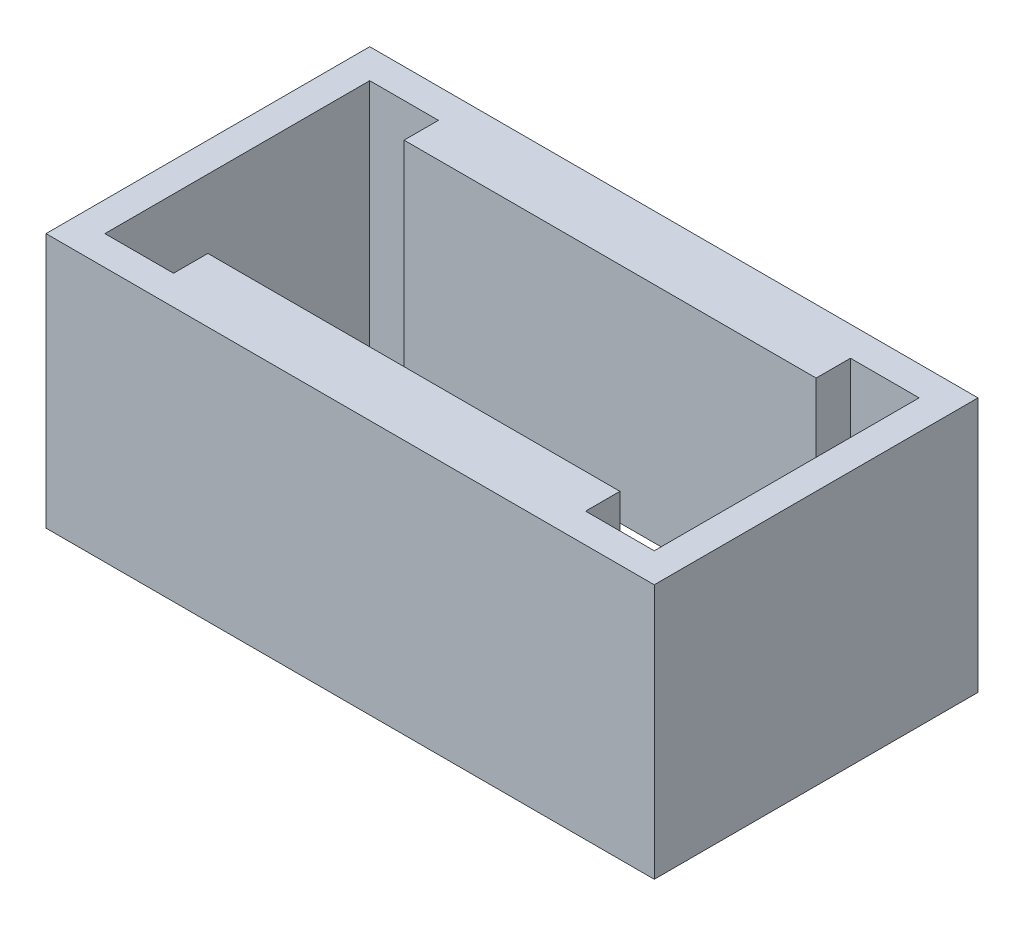
ISO-10303-21;
HEADER;
FILE_DESCRIPTION(('STEP AP214'),'2;1');
FILE_NAME('part.step','',(''),(''),'','','');
FILE_SCHEMA(('AUTOMOTIVE_DESIGN { 1 0 10303 214 1 1 1 1 }'));
ENDSEC;
DATA;
#1=APPLICATION_CONTEXT('core data for automotive mechanical design processes');
#2=APPLICATION_PROTOCOL_DEFINITION('international standard','automotive_design',2000,#1);
#3=PRODUCT_CONTEXT('',#1,'mechanical');
#4=PRODUCT('Part','Part','',(#3));
#5=PRODUCT_RELATED_PRODUCT_CATEGORY('part','',(#4));
#6=PRODUCT_DEFINITION_FORMATION('','',#4);
#7=PRODUCT_DEFINITION_CONTEXT('part definition',#1,'design');
#8=PRODUCT_DEFINITION('design','',#6,#7);
#9=PRODUCT_DEFINITION_SHAPE('','',#8);
#10=(LENGTH_UNIT() NAMED_UNIT(*) SI_UNIT(.MILLI.,.METRE.));
#11=(NAMED_UNIT(*) PLANE_ANGLE_UNIT() SI_UNIT($,.RADIAN.));
#12=(NAMED_UNIT(*) SI_UNIT($,.STERADIAN.) SOLID_ANGLE_UNIT());
#13=UNCERTAINTY_MEASURE_WITH_UNIT(LENGTH_MEASURE(1.E-05),#10,'distance_accuracy_value','');
#14=(GEOMETRIC_REPRESENTATION_CONTEXT(3) GLOBAL_UNCERTAINTY_ASSIGNED_CONTEXT((#13)) GLOBAL_UNIT_ASSIGNED_CONTEXT((#10,
#11,#12)) REPRESENTATION_CONTEXT('',''));
#15=CARTESIAN_POINT('',(0.,0.,0.));
#16=DIRECTION('',(0.,0.,1.));
#17=DIRECTION('',(1.,0.,0.));
#18=AXIS2_PLACEMENT_3D('',#15,#16,#17);
#19=CARTESIAN_POINT('',(10.5,13.,-6.75));
#20=DIRECTION('',(1.,0.,0.));
#21=DIRECTION('',(0.,0.,-1.));
#22=AXIS2_PLACEMENT_3D('',#19,#20,#21);
#23=PLANE('',#22);
#24=DIRECTION('',(0.,-1.,0.));
#25=VECTOR('',#24,1.);
#26=CARTESIAN_POINT('',(10.5,13.,-5.));
#27=LINE('',#26,#25);
#28=CARTESIAN_POINT('',(10.5,13.,-5.));
#29=VERTEX_POINT('',#28);
#30=CARTESIAN_POINT('',(10.5,1.6,-5.));
#31=VERTEX_POINT('',#30);
#32=EDGE_CURVE('E159',#29,#31,#27,.T.);
#33=ORIENTED_EDGE('',*,*,#32,.T.);
#34=DIRECTION('',(0.,0.,1.));
#35=VECTOR('',#34,1.);
#36=CARTESIAN_POINT('',(10.5,1.6,-6.75));
#37=LINE('',#36,#35);
#38=CARTESIAN_POINT('',(10.5,1.6,-6.75));
#39=VERTEX_POINT('',#38);
#40=EDGE_CURVE('E146',#39,#31,#37,.T.);
#41=ORIENTED_EDGE('',*,*,#40,.F.);
#42=DIRECTION('',(0.,-1.,0.));
#43=VECTOR('',#42,1.);
#44=CARTESIAN_POINT('',(10.5,13.,-6.75));
#45=LINE('',#44,#43);
#46=CARTESIAN_POINT('',(10.5,13.,-6.75));
#47=VERTEX_POINT('',#46);
#48=EDGE_CURVE('E156',#47,#39,#45,.T.);
#49=ORIENTED_EDGE('',*,*,#48,.F.);
#50=DIRECTION('',(0.,0.,1.));
#51=VECTOR('',#50,1.);
#52=CARTESIAN_POINT('',(10.5,13.,-6.75));
#53=LINE('',#52,#51);
#54=EDGE_CURVE('E436',#47,#29,#53,.T.);
#55=ORIENTED_EDGE('',*,*,#54,.T.);
#56=EDGE_LOOP('',(#33,#41,#49,#55));
#57=FACE_BOUND('',#56,.T.);
#58=ADVANCED_FACE('F33',(#57),#23,.T.);
#59=CARTESIAN_POINT('',(10.5,13.,-5.));
#60=DIRECTION('',(0.,0.,1.));
#61=DIRECTION('',(1.,0.,0.));
#62=AXIS2_PLACEMENT_3D('',#59,#60,#61);
#63=PLANE('',#62);
#64=DIRECTION('',(0.,-1.,0.));
#65=VECTOR('',#64,1.);
#66=CARTESIAN_POINT('',(-10.5,13.,-5.));
#67=LINE('',#66,#65);
#68=CARTESIAN_POINT('',(-10.5,13.,-5.));
#69=VERTEX_POINT('',#68);
#70=CARTESIAN_POINT('',(-10.5,1.6,-5.));
#71=VERTEX_POINT('',#70);
#72=EDGE_CURVE('E171',#69,#71,#67,.T.);
#73=ORIENTED_EDGE('',*,*,#72,.T.);
#74=DIRECTION('',(-1.,0.,0.));
#75=VECTOR('',#74,1.);
#76=CARTESIAN_POINT('',(10.5,1.6,-5.));
#77=LINE('',#76,#75);
#78=EDGE_CURVE('E160',#31,#71,#77,.T.);
#79=ORIENTED_EDGE('',*,*,#78,.F.);
#80=ORIENTED_EDGE('',*,*,#32,.F.);
#81=DIRECTION('',(-1.,0.,0.));
#82=VECTOR('',#81,1.);
#83=CARTESIAN_POINT('',(10.5,13.,-5.));
#84=LINE('',#83,#82);
#85=EDGE_CURVE('E434',#29,#69,#84,.T.);
#86=ORIENTED_EDGE('',*,*,#85,.T.);
#87=EDGE_LOOP('',(#73,#79,#80,#86));
#88=FACE_BOUND('',#87,.T.);
#89=ADVANCED_FACE('F239',(#88),#63,.T.);
#90=CARTESIAN_POINT('',(-10.5,13.,-6.75));
#91=DIRECTION('',(-1.,0.,0.));
#92=DIRECTION('',(0.,0.,1.));
#93=AXIS2_PLACEMENT_3D('',#90,#91,#92);
#94=PLANE('',#93);
#95=DIRECTION('',(0.,-1.,0.));
#96=VECTOR('',#95,1.);
#97=CARTESIAN_POINT('',(-10.5,13.,-6.75));
#98=LINE('',#97,#96);
#99=CARTESIAN_POINT('',(-10.5,13.,-6.75));
#100=VERTEX_POINT('',#99);
#101=CARTESIAN_POINT('',(-10.5,1.6,-6.75));
#102=VERTEX_POINT('',#101);
#103=EDGE_CURVE('E399',#100,#102,#98,.T.);
#104=ORIENTED_EDGE('',*,*,#103,.T.);
#105=DIRECTION('',(0.,0.,-1.));
#106=VECTOR('',#105,1.);
#107=CARTESIAN_POINT('',(-10.5,1.6,-6.75000000000001));
#108=LINE('',#107,#106);
#109=EDGE_CURVE('E48',#71,#102,#108,.T.);
#110=ORIENTED_EDGE('',*,*,#109,.F.);
#111=ORIENTED_EDGE('',*,*,#72,.F.);
#112=DIRECTION('',(0.,0.,-1.));
#113=VECTOR('',#112,1.);
#114=CARTESIAN_POINT('',(-10.5,13.,-6.75));
#115=LINE('',#114,#113);
#116=EDGE_CURVE('E403',#69,#100,#115,.T.);
#117=ORIENTED_EDGE('',*,*,#116,.T.);
#118=EDGE_LOOP('',(#104,#110,#111,#117));
#119=FACE_BOUND('',#118,.T.);
#120=ADVANCED_FACE('F244',(#119),#94,.T.);
#121=CARTESIAN_POINT('',(0.,13.,0.));
#122=DIRECTION('',(0.,1.,0.));
#123=DIRECTION('',(0.,0.,1.));
#124=AXIS2_PLACEMENT_3D('',#121,#122,#123);
#125=PLANE('',#124);
#126=DIRECTION('',(0.,0.,1.));
#127=VECTOR('',#126,1.);
#128=CARTESIAN_POINT('',(-15.5,13.,8.25));
#129=LINE('',#128,#127);
#130=CARTESIAN_POINT('',(-15.5,13.,-8.25));
#131=VERTEX_POINT('',#130);
#132=CARTESIAN_POINT('',(-15.5,13.,8.25));
#133=VERTEX_POINT('',#132);
#134=EDGE_CURVE('E186',#131,#133,#129,.T.);
#135=ORIENTED_EDGE('',*,*,#134,.T.);
#136=DIRECTION('',(1.,0.,0.));
#137=VECTOR('',#136,1.);
#138=CARTESIAN_POINT('',(15.5,13.,8.25));
#139=LINE('',#138,#137);
#140=CARTESIAN_POINT('',(15.5,13.,8.25));
#141=VERTEX_POINT('',#140);
#142=EDGE_CURVE('E189',#133,#141,#139,.T.);
#143=ORIENTED_EDGE('',*,*,#142,.T.);
#144=DIRECTION('',(0.,0.,-1.));
#145=VECTOR('',#144,1.);
#146=CARTESIAN_POINT('',(15.5,13.,8.25));
#147=LINE('',#146,#145);
#148=CARTESIAN_POINT('',(15.5,13.,-8.25));
#149=VERTEX_POINT('',#148);
#150=EDGE_CURVE('E192',#141,#149,#147,.T.);
#151=ORIENTED_EDGE('',*,*,#150,.T.);
#152=DIRECTION('',(-1.,0.,0.));
#153=VECTOR('',#152,1.);
#154=CARTESIAN_POINT('',(15.5,13.,-8.25));
#155=LINE('',#154,#153);
#156=EDGE_CURVE('E194',#149,#131,#155,.T.);
#157=ORIENTED_EDGE('',*,*,#156,.T.);
#158=EDGE_LOOP('',(#135,#143,#151,#157));
#159=FACE_BOUND('',#158,.T.);
#160=DIRECTION('',(1.,0.,0.));
#161=VECTOR('',#160,1.);
#162=CARTESIAN_POINT('',(10.5,13.,5.));
#163=LINE('',#162,#161);
#164=CARTESIAN_POINT('',(-10.5,13.,5.));
#165=VERTEX_POINT('',#164);
#166=CARTESIAN_POINT('',(10.5,13.,5.));
#167=VERTEX_POINT('',#166);
#168=EDGE_CURVE('E445',#165,#167,#163,.T.);
#169=ORIENTED_EDGE('',*,*,#168,.F.);
#170=DIRECTION('',(0.,0.,-1.));
#171=VECTOR('',#170,1.);
#172=CARTESIAN_POINT('',(-10.5,13.,6.75));
#173=LINE('',#172,#171);
#174=CARTESIAN_POINT('',(-10.5,13.,6.75));
#175=VERTEX_POINT('',#174);
#176=EDGE_CURVE('E418',#175,#165,#173,.T.);
#177=ORIENTED_EDGE('',*,*,#176,.F.);
#178=DIRECTION('',(1.,0.,0.));
#179=VECTOR('',#178,1.);
#180=CARTESIAN_POINT('',(-10.5,13.,6.75));
#181=LINE('',#180,#179);
#182=CARTESIAN_POINT('',(-14.,13.,6.75));
#183=VERTEX_POINT('',#182);
#184=EDGE_CURVE('E414',#183,#175,#181,.T.);
#185=ORIENTED_EDGE('',*,*,#184,.F.);
#186=DIRECTION('',(0.,0.,1.));
#187=VECTOR('',#186,1.);
#188=CARTESIAN_POINT('',(-14.,13.,6.75));
#189=LINE('',#188,#187);
#190=CARTESIAN_POINT('',(-14.,13.,-6.75));
#191=VERTEX_POINT('',#190);
#192=EDGE_CURVE('E429',#191,#183,#189,.T.);
#193=ORIENTED_EDGE('',*,*,#192,.F.);
#194=DIRECTION('',(-1.,0.,0.));
#195=VECTOR('',#194,1.);
#196=CARTESIAN_POINT('',(-10.5,13.,-6.75));
#197=LINE('',#196,#195);
#198=EDGE_CURVE('E431',#100,#191,#197,.T.);
#199=ORIENTED_EDGE('',*,*,#198,.F.);
#200=ORIENTED_EDGE('',*,*,#116,.F.);
#201=ORIENTED_EDGE('',*,*,#85,.F.);
#202=ORIENTED_EDGE('',*,*,#54,.F.);
#203=DIRECTION('',(-1.,0.,0.));
#204=VECTOR('',#203,1.);
#205=CARTESIAN_POINT('',(10.5,13.,-6.75));
#206=LINE('',#205,#204);
#207=CARTESIAN_POINT('',(14.,13.,-6.75));
#208=VERTEX_POINT('',#207);
#209=EDGE_CURVE('E166',#208,#47,#206,.T.);
#210=ORIENTED_EDGE('',*,*,#209,.F.);
#211=DIRECTION('',(0.,0.,-1.));
#212=VECTOR('',#211,1.);
#213=CARTESIAN_POINT('',(14.,13.,6.75));
#214=LINE('',#213,#212);
#215=CARTESIAN_POINT('',(14.,13.,6.75));
#216=VERTEX_POINT('',#215);
#217=EDGE_CURVE('E439',#216,#208,#214,.T.);
#218=ORIENTED_EDGE('',*,*,#217,.F.);
#219=DIRECTION('',(1.,0.,0.));
#220=VECTOR('',#219,1.);
#221=CARTESIAN_POINT('',(10.5,13.,6.75));
#222=LINE('',#221,#220);
#223=CARTESIAN_POINT('',(10.5,13.,6.75));
#224=VERTEX_POINT('',#223);
#225=EDGE_CURVE('E441',#224,#216,#222,.T.);
#226=ORIENTED_EDGE('',*,*,#225,.F.);
#227=DIRECTION('',(0.,0.,1.));
#228=VECTOR('',#227,1.);
#229=CARTESIAN_POINT('',(10.5,13.,5.));
#230=LINE('',#229,#228);
#231=EDGE_CURVE('E443',#167,#224,#230,.T.);
#232=ORIENTED_EDGE('',*,*,#231,.F.);
#233=EDGE_LOOP('',(#169,#177,#185,#193,#199,#200,#201,#202,#210,#218,#226,#232));
#234=FACE_BOUND('',#233,.T.);
#235=ADVANCED_FACE('F229',(#159,#234),#125,.T.);
#236=CARTESIAN_POINT('',(0.,0.,0.));
#237=DIRECTION('',(0.,1.,0.));
#238=DIRECTION('',(0.,0.,1.));
#239=AXIS2_PLACEMENT_3D('',#236,#237,#238);
#240=PLANE('',#239);
#241=DIRECTION('',(0.,0.,1.));
#242=VECTOR('',#241,1.);
#243=CARTESIAN_POINT('',(-15.5,0.,8.25));
#244=LINE('',#243,#242);
#245=CARTESIAN_POINT('',(-15.5,0.,-8.25));
#246=VERTEX_POINT('',#245);
#247=CARTESIAN_POINT('',(-15.5,0.,8.25));
#248=VERTEX_POINT('',#247);
#249=EDGE_CURVE('E185',#246,#248,#244,.T.);
#250=ORIENTED_EDGE('',*,*,#249,.F.);
#251=DIRECTION('',(-1.,0.,0.));
#252=VECTOR('',#251,1.);
#253=CARTESIAN_POINT('',(15.5,0.,-8.25));
#254=LINE('',#253,#252);
#255=CARTESIAN_POINT('',(15.5,0.,-8.25));
#256=VERTEX_POINT('',#255);
#257=EDGE_CURVE('E190',#256,#246,#254,.T.);
#258=ORIENTED_EDGE('',*,*,#257,.F.);
#259=DIRECTION('',(0.,0.,-1.));
#260=VECTOR('',#259,1.);
#261=CARTESIAN_POINT('',(15.5,0.,8.25));
#262=LINE('',#261,#260);
#263=CARTESIAN_POINT('',(15.5,0.,8.25));
#264=VERTEX_POINT('',#263);
#265=EDGE_CURVE('E201',#264,#256,#262,.T.);
#266=ORIENTED_EDGE('',*,*,#265,.F.);
#267=DIRECTION('',(1.,0.,0.));
#268=VECTOR('',#267,1.);
#269=CARTESIAN_POINT('',(15.5,0.,8.25));
#270=LINE('',#269,#268);
#271=EDGE_CURVE('E199',#248,#264,#270,.T.);
#272=ORIENTED_EDGE('',*,*,#271,.F.);
#273=EDGE_LOOP('',(#250,#258,#266,#272));
#274=FACE_BOUND('',#273,.T.);
#275=DIRECTION('',(-1.,0.,0.));
#276=VECTOR('',#275,1.);
#277=CARTESIAN_POINT('',(10.5,0.,-6.75));
#278=LINE('',#277,#276);
#279=CARTESIAN_POINT('',(14.,0.,-6.75));
#280=VERTEX_POINT('',#279);
#281=CARTESIAN_POINT('',(-14.,0.,-6.75));
#282=VERTEX_POINT('',#281);
#283=EDGE_CURVE('E419',#280,#282,#278,.T.);
#284=ORIENTED_EDGE('',*,*,#283,.T.);
#285=DIRECTION('',(0.,0.,1.));
#286=VECTOR('',#285,1.);
#287=CARTESIAN_POINT('',(-14.,0.,6.75));
#288=LINE('',#287,#286);
#289=CARTESIAN_POINT('',(-14.,0.,6.75));
#290=VERTEX_POINT('',#289);
#291=EDGE_CURVE('E415',#282,#290,#288,.T.);
#292=ORIENTED_EDGE('',*,*,#291,.T.);
#293=DIRECTION('',(1.,0.,0.));
#294=VECTOR('',#293,1.);
#295=CARTESIAN_POINT('',(10.5,0.,6.75));
#296=LINE('',#295,#294);
#297=CARTESIAN_POINT('',(14.,0.,6.75));
#298=VERTEX_POINT('',#297);
#299=EDGE_CURVE('E424',#290,#298,#296,.T.);
#300=ORIENTED_EDGE('',*,*,#299,.T.);
#301=DIRECTION('',(0.,0.,-1.));
#302=VECTOR('',#301,1.);
#303=CARTESIAN_POINT('',(14.,0.,6.75));
#304=LINE('',#303,#302);
#305=EDGE_CURVE('E421',#298,#280,#304,.T.);
#306=ORIENTED_EDGE('',*,*,#305,.T.);
#307=EDGE_LOOP('',(#284,#292,#300,#306));
#308=FACE_BOUND('',#307,.T.);
#309=ADVANCED_FACE('F219',(#274,#308),#240,.F.);
#310=CARTESIAN_POINT('',(-15.5,13.,8.25));
#311=DIRECTION('',(1.,0.,0.));
#312=DIRECTION('',(0.,0.,-1.));
#313=AXIS2_PLACEMENT_3D('',#310,#311,#312);
#314=PLANE('',#313);
#315=ORIENTED_EDGE('',*,*,#249,.T.);
#316=DIRECTION('',(0.,-1.,0.));
#317=VECTOR('',#316,1.);
#318=CARTESIAN_POINT('',(-15.5,13.,8.25));
#319=LINE('',#318,#317);
#320=EDGE_CURVE('E11',#133,#248,#319,.T.);
#321=ORIENTED_EDGE('',*,*,#320,.F.);
#322=ORIENTED_EDGE('',*,*,#134,.F.);
#323=DIRECTION('',(0.,-1.,0.));
#324=VECTOR('',#323,1.);
#325=CARTESIAN_POINT('',(-15.5,13.,-8.25));
#326=LINE('',#325,#324);
#327=EDGE_CURVE('E196',#131,#246,#326,.T.);
#328=ORIENTED_EDGE('',*,*,#327,.T.);
#329=EDGE_LOOP('',(#315,#321,#322,#328));
#330=FACE_BOUND('',#329,.T.);
#331=ADVANCED_FACE('F35',(#330),#314,.F.);
#332=CARTESIAN_POINT('',(15.5,13.,8.25));
#333=DIRECTION('',(0.,0.,-1.));
#334=DIRECTION('',(-1.,0.,0.));
#335=AXIS2_PLACEMENT_3D('',#332,#333,#334);
#336=PLANE('',#335);
#337=ORIENTED_EDGE('',*,*,#271,.T.);
#338=DIRECTION('',(0.,-1.,0.));
#339=VECTOR('',#338,1.);
#340=CARTESIAN_POINT('',(15.5,13.,8.25));
#341=LINE('',#340,#339);
#342=EDGE_CURVE('E41',#141,#264,#341,.T.);
#343=ORIENTED_EDGE('',*,*,#342,.F.);
#344=ORIENTED_EDGE('',*,*,#142,.F.);
#345=ORIENTED_EDGE('',*,*,#320,.T.);
#346=EDGE_LOOP('',(#337,#343,#344,#345));
#347=FACE_BOUND('',#346,.T.);
#348=ADVANCED_FACE('F231',(#347),#336,.F.);
#349=CARTESIAN_POINT('',(15.5,13.,8.25));
#350=DIRECTION('',(-1.,0.,0.));
#351=DIRECTION('',(0.,0.,1.));
#352=AXIS2_PLACEMENT_3D('',#349,#350,#351);
#353=PLANE('',#352);
#354=ORIENTED_EDGE('',*,*,#265,.T.);
#355=DIRECTION('',(0.,-1.,0.));
#356=VECTOR('',#355,1.);
#357=CARTESIAN_POINT('',(15.5,13.,-8.25));
#358=LINE('',#357,#356);
#359=EDGE_CURVE('E206',#149,#256,#358,.T.);
#360=ORIENTED_EDGE('',*,*,#359,.F.);
#361=ORIENTED_EDGE('',*,*,#150,.F.);
#362=ORIENTED_EDGE('',*,*,#342,.T.);
#363=EDGE_LOOP('',(#354,#360,#361,#362));
#364=FACE_BOUND('',#363,.T.);
#365=ADVANCED_FACE('F213',(#364),#353,.F.);
#366=CARTESIAN_POINT('',(15.5,13.,-8.25));
#367=DIRECTION('',(0.,0.,1.));
#368=DIRECTION('',(1.,0.,0.));
#369=AXIS2_PLACEMENT_3D('',#366,#367,#368);
#370=PLANE('',#369);
#371=ORIENTED_EDGE('',*,*,#257,.T.);
#372=ORIENTED_EDGE('',*,*,#327,.F.);
#373=ORIENTED_EDGE('',*,*,#156,.F.);
#374=ORIENTED_EDGE('',*,*,#359,.T.);
#375=EDGE_LOOP('',(#371,#372,#373,#374));
#376=FACE_BOUND('',#375,.T.);
#377=ADVANCED_FACE('F223',(#376),#370,.F.);
#378=CARTESIAN_POINT('',(-10.5,13.,6.75));
#379=DIRECTION('',(-1.,0.,0.));
#380=DIRECTION('',(0.,0.,1.));
#381=AXIS2_PLACEMENT_3D('',#378,#379,#380);
#382=PLANE('',#381);
#383=DIRECTION('',(0.,0.,-1.));
#384=VECTOR('',#383,1.);
#385=CARTESIAN_POINT('',(-10.5,1.6,6.75));
#386=LINE('',#385,#384);
#387=CARTESIAN_POINT('',(-10.5,1.6,6.75));
#388=VERTEX_POINT('',#387);
#389=CARTESIAN_POINT('',(-10.5,1.6,5.));
#390=VERTEX_POINT('',#389);
#391=EDGE_CURVE('E453',#388,#390,#386,.T.);
#392=ORIENTED_EDGE('',*,*,#391,.F.);
#393=DIRECTION('',(0.,-1.,0.));
#394=VECTOR('',#393,1.);
#395=CARTESIAN_POINT('',(-10.5,13.,6.75));
#396=LINE('',#395,#394);
#397=EDGE_CURVE('E411',#175,#388,#396,.T.);
#398=ORIENTED_EDGE('',*,*,#397,.F.);
#399=ORIENTED_EDGE('',*,*,#176,.T.);
#400=DIRECTION('',(0.,-1.,0.));
#401=VECTOR('',#400,1.);
#402=CARTESIAN_POINT('',(-10.5,13.,5.));
#403=LINE('',#402,#401);
#404=EDGE_CURVE('E182',#165,#390,#403,.T.);
#405=ORIENTED_EDGE('',*,*,#404,.T.);
#406=EDGE_LOOP('',(#392,#398,#399,#405));
#407=FACE_BOUND('',#406,.T.);
#408=ADVANCED_FACE('F266',(#407),#382,.T.);
#409=CARTESIAN_POINT('',(10.5,13.,5.));
#410=DIRECTION('',(0.,0.,-1.));
#411=DIRECTION('',(-1.,0.,0.));
#412=AXIS2_PLACEMENT_3D('',#409,#410,#411);
#413=PLANE('',#412);
#414=DIRECTION('',(1.,0.,0.));
#415=VECTOR('',#414,1.);
#416=CARTESIAN_POINT('',(10.5,1.6,5.));
#417=LINE('',#416,#415);
#418=CARTESIAN_POINT('',(10.5,1.6,5.));
#419=VERTEX_POINT('',#418);
#420=EDGE_CURVE('E451',#390,#419,#417,.T.);
#421=ORIENTED_EDGE('',*,*,#420,.F.);
#422=ORIENTED_EDGE('',*,*,#404,.F.);
#423=ORIENTED_EDGE('',*,*,#168,.T.);
#424=DIRECTION('',(0.,-1.,0.));
#425=VECTOR('',#424,1.);
#426=CARTESIAN_POINT('',(10.5,13.,5.));
#427=LINE('',#426,#425);
#428=EDGE_CURVE('E179',#167,#419,#427,.T.);
#429=ORIENTED_EDGE('',*,*,#428,.T.);
#430=EDGE_LOOP('',(#421,#422,#423,#429));
#431=FACE_BOUND('',#430,.T.);
#432=ADVANCED_FACE('F262',(#431),#413,.T.);
#433=CARTESIAN_POINT('',(10.5,13.,5.));
#434=DIRECTION('',(1.,0.,0.));
#435=DIRECTION('',(0.,0.,-1.));
#436=AXIS2_PLACEMENT_3D('',#433,#434,#435);
#437=PLANE('',#436);
#438=DIRECTION('',(0.,0.,1.));
#439=VECTOR('',#438,1.);
#440=CARTESIAN_POINT('',(10.5,1.6,6.75));
#441=LINE('',#440,#439);
#442=CARTESIAN_POINT('',(10.5,1.6,6.75));
#443=VERTEX_POINT('',#442);
#444=EDGE_CURVE('E449',#419,#443,#441,.T.);
#445=ORIENTED_EDGE('',*,*,#444,.F.);
#446=ORIENTED_EDGE('',*,*,#428,.F.);
#447=ORIENTED_EDGE('',*,*,#231,.T.);
#448=DIRECTION('',(0.,-1.,0.));
#449=VECTOR('',#448,1.);
#450=CARTESIAN_POINT('',(10.5,13.,6.75));
#451=LINE('',#450,#449);
#452=EDGE_CURVE('E176',#224,#443,#451,.T.);
#453=ORIENTED_EDGE('',*,*,#452,.T.);
#454=EDGE_LOOP('',(#445,#446,#447,#453));
#455=FACE_BOUND('',#454,.T.);
#456=ADVANCED_FACE('F259',(#455),#437,.T.);
#457=CARTESIAN_POINT('',(10.5,13.,6.75));
#458=DIRECTION('',(0.,0.,-1.));
#459=DIRECTION('',(-1.,0.,0.));
#460=AXIS2_PLACEMENT_3D('',#457,#458,#459);
#461=PLANE('',#460);
#462=ORIENTED_EDGE('',*,*,#299,.F.);
#463=DIRECTION('',(0.,-1.,0.));
#464=VECTOR('',#463,1.);
#465=CARTESIAN_POINT('',(-14.,13.,6.75));
#466=LINE('',#465,#464);
#467=EDGE_CURVE('E56',#183,#290,#466,.T.);
#468=ORIENTED_EDGE('',*,*,#467,.F.);
#469=ORIENTED_EDGE('',*,*,#184,.T.);
#470=ORIENTED_EDGE('',*,*,#397,.T.);
#471=DIRECTION('',(-1.,0.,0.));
#472=VECTOR('',#471,1.);
#473=CARTESIAN_POINT('',(10.5,1.6,6.75));
#474=LINE('',#473,#472);
#475=EDGE_CURVE('E427',#443,#388,#474,.T.);
#476=ORIENTED_EDGE('',*,*,#475,.F.);
#477=ORIENTED_EDGE('',*,*,#452,.F.);
#478=ORIENTED_EDGE('',*,*,#225,.T.);
#479=DIRECTION('',(0.,-1.,0.));
#480=VECTOR('',#479,1.);
#481=CARTESIAN_POINT('',(14.,13.,6.75));
#482=LINE('',#481,#480);
#483=EDGE_CURVE('E169',#216,#298,#482,.T.);
#484=ORIENTED_EDGE('',*,*,#483,.T.);
#485=EDGE_LOOP('',(#462,#468,#469,#470,#476,#477,#478,#484));
#486=FACE_BOUND('',#485,.T.);
#487=ADVANCED_FACE('F255',(#486),#461,.T.);
#488=CARTESIAN_POINT('',(14.,13.,6.75));
#489=DIRECTION('',(-1.,0.,0.));
#490=DIRECTION('',(0.,0.,1.));
#491=AXIS2_PLACEMENT_3D('',#488,#489,#490);
#492=PLANE('',#491);
#493=ORIENTED_EDGE('',*,*,#305,.F.);
#494=ORIENTED_EDGE('',*,*,#483,.F.);
#495=ORIENTED_EDGE('',*,*,#217,.T.);
#496=DIRECTION('',(0.,-1.,0.));
#497=VECTOR('',#496,1.);
#498=CARTESIAN_POINT('',(14.,13.,-6.75));
#499=LINE('',#498,#497);
#500=EDGE_CURVE('E167',#208,#280,#499,.T.);
#501=ORIENTED_EDGE('',*,*,#500,.T.);
#502=EDGE_LOOP('',(#493,#494,#495,#501));
#503=FACE_BOUND('',#502,.T.);
#504=ADVANCED_FACE('F252',(#503),#492,.T.);
#505=CARTESIAN_POINT('',(10.5,13.,-6.75));
#506=DIRECTION('',(0.,0.,1.));
#507=DIRECTION('',(1.,0.,0.));
#508=AXIS2_PLACEMENT_3D('',#505,#506,#507);
#509=PLANE('',#508);
#510=ORIENTED_EDGE('',*,*,#283,.F.);
#511=ORIENTED_EDGE('',*,*,#500,.F.);
#512=ORIENTED_EDGE('',*,*,#209,.T.);
#513=ORIENTED_EDGE('',*,*,#48,.T.);
#514=DIRECTION('',(1.,0.,0.));
#515=VECTOR('',#514,1.);
#516=CARTESIAN_POINT('',(10.5,1.6,-6.75));
#517=LINE('',#516,#515);
#518=EDGE_CURVE('E143',#102,#39,#517,.T.);
#519=ORIENTED_EDGE('',*,*,#518,.F.);
#520=ORIENTED_EDGE('',*,*,#103,.F.);
#521=ORIENTED_EDGE('',*,*,#198,.T.);
#522=DIRECTION('',(0.,-1.,0.));
#523=VECTOR('',#522,1.);
#524=CARTESIAN_POINT('',(-14.,13.,-6.75));
#525=LINE('',#524,#523);
#526=EDGE_CURVE('E405',#191,#282,#525,.T.);
#527=ORIENTED_EDGE('',*,*,#526,.T.);
#528=EDGE_LOOP('',(#510,#511,#512,#513,#519,#520,#521,#527));
#529=FACE_BOUND('',#528,.T.);
#530=ADVANCED_FACE('F163',(#529),#509,.T.);
#531=CARTESIAN_POINT('',(-14.,13.,6.75));
#532=DIRECTION('',(1.,0.,0.));
#533=DIRECTION('',(0.,0.,-1.));
#534=AXIS2_PLACEMENT_3D('',#531,#532,#533);
#535=PLANE('',#534);
#536=ORIENTED_EDGE('',*,*,#291,.F.);
#537=ORIENTED_EDGE('',*,*,#526,.F.);
#538=ORIENTED_EDGE('',*,*,#192,.T.);
#539=ORIENTED_EDGE('',*,*,#467,.T.);
#540=EDGE_LOOP('',(#536,#537,#538,#539));
#541=FACE_BOUND('',#540,.T.);
#542=ADVANCED_FACE('F251',(#541),#535,.T.);
#543=CARTESIAN_POINT('',(0.,1.6,0.));
#544=DIRECTION('',(0.,1.,0.));
#545=DIRECTION('',(0.,0.,1.));
#546=AXIS2_PLACEMENT_3D('',#543,#544,#545);
#547=PLANE('',#546);
#548=ORIENTED_EDGE('',*,*,#391,.T.);
#549=ORIENTED_EDGE('',*,*,#420,.T.);
#550=ORIENTED_EDGE('',*,*,#444,.T.);
#551=ORIENTED_EDGE('',*,*,#475,.T.);
#552=EDGE_LOOP('',(#548,#549,#550,#551));
#553=FACE_BOUND('',#552,.T.);
#554=ADVANCED_FACE('F312',(#553),#547,.F.);
#555=CARTESIAN_POINT('',(0.,1.6,0.));
#556=DIRECTION('',(0.,-1.,0.));
#557=DIRECTION('',(0.,0.,-1.));
#558=AXIS2_PLACEMENT_3D('',#555,#556,#557);
#559=PLANE('',#558);
#560=ORIENTED_EDGE('',*,*,#109,.T.);
#561=ORIENTED_EDGE('',*,*,#518,.T.);
#562=ORIENTED_EDGE('',*,*,#40,.T.);
#563=ORIENTED_EDGE('',*,*,#78,.T.);
#564=EDGE_LOOP('',(#560,#561,#562,#563));
#565=FACE_BOUND('',#564,.T.);
#566=ADVANCED_FACE('F145',(#565),#559,.T.);
#567=CLOSED_SHELL('',(#58,#89,#120,#235,#309,#331,#348,#365,#377,#408,#432,#456,#487,#504,#530,
#542,#554,#566));
#568=MANIFOLD_SOLID_BREP('B2',#567);
#569=ADVANCED_BREP_SHAPE_REPRESENTATION('',(#18,#568),#14);
#570=SHAPE_DEFINITION_REPRESENTATION(#9,#569);
ENDSEC;
END-ISO-10303-21;
